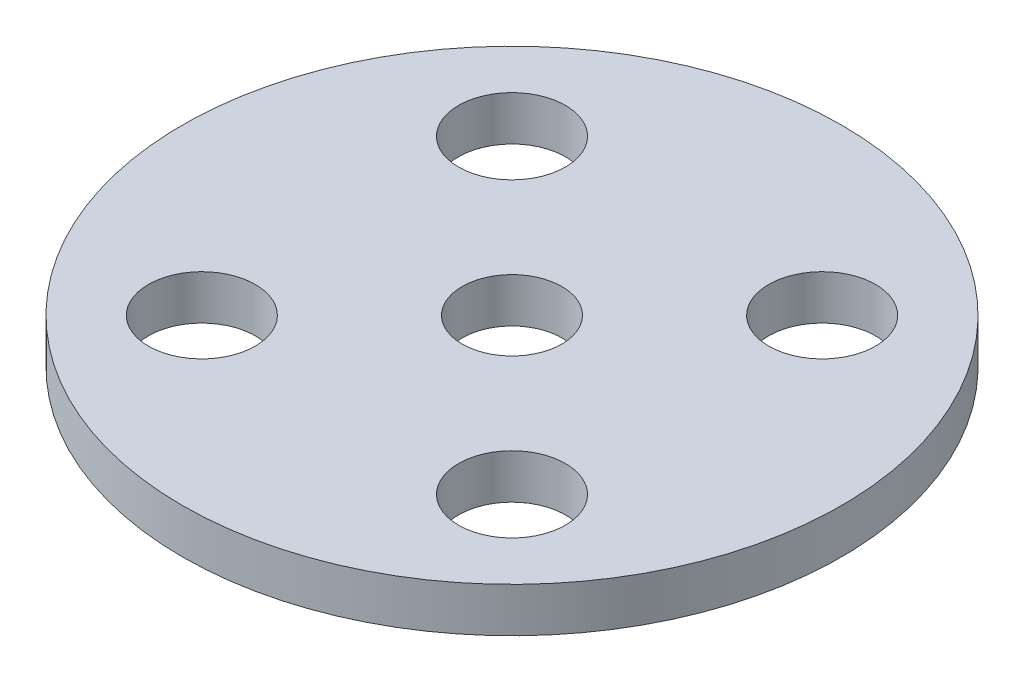
ISO-10303-21;
HEADER;
FILE_DESCRIPTION(('STEP AP214'),'2;1');
FILE_NAME('part.step','',(''),(''),'','','');
FILE_SCHEMA(('AUTOMOTIVE_DESIGN { 1 0 10303 214 1 1 1 1 }'));
ENDSEC;
DATA;
#1=APPLICATION_CONTEXT('core data for automotive mechanical design processes');
#2=APPLICATION_PROTOCOL_DEFINITION('international standard','automotive_design',2000,#1);
#3=PRODUCT_CONTEXT('',#1,'mechanical');
#4=PRODUCT('Part','Part','',(#3));
#5=PRODUCT_RELATED_PRODUCT_CATEGORY('part','',(#4));
#6=PRODUCT_DEFINITION_FORMATION('','',#4);
#7=PRODUCT_DEFINITION_CONTEXT('part definition',#1,'design');
#8=PRODUCT_DEFINITION('design','',#6,#7);
#9=PRODUCT_DEFINITION_SHAPE('','',#8);
#10=(LENGTH_UNIT() NAMED_UNIT(*) SI_UNIT(.MILLI.,.METRE.));
#11=(NAMED_UNIT(*) PLANE_ANGLE_UNIT() SI_UNIT($,.RADIAN.));
#12=(NAMED_UNIT(*) SI_UNIT($,.STERADIAN.) SOLID_ANGLE_UNIT());
#13=UNCERTAINTY_MEASURE_WITH_UNIT(LENGTH_MEASURE(1.E-05),#10,'distance_accuracy_value','');
#14=(GEOMETRIC_REPRESENTATION_CONTEXT(3) GLOBAL_UNCERTAINTY_ASSIGNED_CONTEXT((#13)) GLOBAL_UNIT_ASSIGNED_CONTEXT((#10,
#11,#12)) REPRESENTATION_CONTEXT('',''));
#15=CARTESIAN_POINT('',(0.,0.,0.));
#16=DIRECTION('',(0.,0.,1.));
#17=DIRECTION('',(1.,0.,0.));
#18=AXIS2_PLACEMENT_3D('',#15,#16,#17);
#19=CARTESIAN_POINT('',(0.,3.175,0.));
#20=DIRECTION('',(0.,1.,0.));
#21=DIRECTION('',(0.,0.,1.));
#22=AXIS2_PLACEMENT_3D('',#19,#20,#21);
#23=PLANE('',#22);
#24=CARTESIAN_POINT('',(11.0558684656939,3.175,-11.0558684657014));
#25=DIRECTION('',(0.,1.,0.));
#26=DIRECTION('',(0.,0.,1.));
#27=AXIS2_PLACEMENT_3D('',#24,#25,#26);
#28=CIRCLE('',#27,3.81);
#29=CARTESIAN_POINT('',(11.0558684656939,3.175,-7.24586846570139));
#30=VERTEX_POINT('',#29);
#31=EDGE_CURVE('E60',#30,#30,#28,.T.);
#32=ORIENTED_EDGE('',*,*,#31,.F.);
#33=EDGE_LOOP('',(#32));
#34=FACE_BOUND('',#33,.T.);
#35=CARTESIAN_POINT('',(0.,3.175,0.));
#36=DIRECTION('',(0.,1.,0.));
#37=DIRECTION('',(0.,0.,1.));
#38=AXIS2_PLACEMENT_3D('',#35,#36,#37);
#39=CIRCLE('',#38,3.556);
#40=CARTESIAN_POINT('',(0.,3.175,3.55600000000001));
#41=VERTEX_POINT('',#40);
#42=EDGE_CURVE('E48',#41,#41,#39,.T.);
#43=ORIENTED_EDGE('',*,*,#42,.F.);
#44=EDGE_LOOP('',(#43));
#45=FACE_BOUND('',#44,.T.);
#46=CARTESIAN_POINT('',(0.,3.175,0.));
#47=DIRECTION('',(0.,1.,0.));
#48=DIRECTION('',(0.,0.,1.));
#49=AXIS2_PLACEMENT_3D('',#46,#47,#48);
#50=CIRCLE('',#49,23.495);
#51=CARTESIAN_POINT('',(0.,3.175,23.495));
#52=VERTEX_POINT('',#51);
#53=EDGE_CURVE('E10',#52,#52,#50,.T.);
#54=ORIENTED_EDGE('',*,*,#53,.T.);
#55=EDGE_LOOP('',(#54));
#56=FACE_BOUND('',#55,.T.);
#57=CARTESIAN_POINT('',(-11.0558684656958,3.175,-11.0558684656958));
#58=DIRECTION('',(0.,1.,0.));
#59=DIRECTION('',(0.,0.,1.));
#60=AXIS2_PLACEMENT_3D('',#57,#58,#59);
#61=CIRCLE('',#60,3.81);
#62=CARTESIAN_POINT('',(-11.0558684656958,3.175,-7.24586846569578));
#63=VERTEX_POINT('',#62);
#64=EDGE_CURVE('E43',#63,#63,#61,.T.);
#65=ORIENTED_EDGE('',*,*,#64,.F.);
#66=EDGE_LOOP('',(#65));
#67=FACE_BOUND('',#66,.T.);
#68=CARTESIAN_POINT('',(11.0558684656958,3.175,11.0558684656958));
#69=DIRECTION('',(0.,1.,0.));
#70=DIRECTION('',(0.,0.,1.));
#71=AXIS2_PLACEMENT_3D('',#68,#69,#70);
#72=CIRCLE('',#71,3.81);
#73=CARTESIAN_POINT('',(11.0558684656958,3.175,14.8658684656958));
#74=VERTEX_POINT('',#73);
#75=EDGE_CURVE('E54',#74,#74,#72,.T.);
#76=ORIENTED_EDGE('',*,*,#75,.F.);
#77=EDGE_LOOP('',(#76));
#78=FACE_BOUND('',#77,.T.);
#79=CARTESIAN_POINT('',(-11.0558684656939,3.175,11.0558684656939));
#80=DIRECTION('',(0.,1.,0.));
#81=DIRECTION('',(0.,0.,1.));
#82=AXIS2_PLACEMENT_3D('',#79,#80,#81);
#83=CIRCLE('',#82,3.81);
#84=CARTESIAN_POINT('',(-11.0558684656939,3.175,14.8658684656939));
#85=VERTEX_POINT('',#84);
#86=EDGE_CURVE('E66',#85,#85,#83,.T.);
#87=ORIENTED_EDGE('',*,*,#86,.F.);
#88=EDGE_LOOP('',(#87));
#89=FACE_BOUND('',#88,.T.);
#90=ADVANCED_FACE('F32',(#34,#45,#56,#67,#78,#89),#23,.T.);
#91=CARTESIAN_POINT('',(0.,0.,0.));
#92=DIRECTION('',(0.,1.,0.));
#93=DIRECTION('',(0.,0.,1.));
#94=AXIS2_PLACEMENT_3D('',#91,#92,#93);
#95=PLANE('',#94);
#96=CARTESIAN_POINT('',(0.,0.,0.));
#97=DIRECTION('',(0.,1.,0.));
#98=DIRECTION('',(0.,0.,1.));
#99=AXIS2_PLACEMENT_3D('',#96,#97,#98);
#100=CIRCLE('',#99,23.495);
#101=CARTESIAN_POINT('',(0.,0.,23.495));
#102=VERTEX_POINT('',#101);
#103=EDGE_CURVE('E36',#102,#102,#100,.T.);
#104=ORIENTED_EDGE('',*,*,#103,.F.);
#105=EDGE_LOOP('',(#104));
#106=FACE_BOUND('',#105,.T.);
#107=CARTESIAN_POINT('',(-11.0558684656958,0.,-11.0558684656958));
#108=DIRECTION('',(0.,1.,0.));
#109=DIRECTION('',(0.,0.,1.));
#110=AXIS2_PLACEMENT_3D('',#107,#108,#109);
#111=CIRCLE('',#110,3.81);
#112=CARTESIAN_POINT('',(-11.0558684656958,0.,-7.24586846569578));
#113=VERTEX_POINT('',#112);
#114=EDGE_CURVE('E45',#113,#113,#111,.T.);
#115=ORIENTED_EDGE('',*,*,#114,.T.);
#116=EDGE_LOOP('',(#115));
#117=FACE_BOUND('',#116,.T.);
#118=CARTESIAN_POINT('',(0.,0.,0.));
#119=DIRECTION('',(0.,1.,0.));
#120=DIRECTION('',(0.,0.,1.));
#121=AXIS2_PLACEMENT_3D('',#118,#119,#120);
#122=CIRCLE('',#121,3.556);
#123=CARTESIAN_POINT('',(0.,0.,3.55600000000001));
#124=VERTEX_POINT('',#123);
#125=EDGE_CURVE('E51',#124,#124,#122,.T.);
#126=ORIENTED_EDGE('',*,*,#125,.T.);
#127=EDGE_LOOP('',(#126));
#128=FACE_BOUND('',#127,.T.);
#129=CARTESIAN_POINT('',(11.0558684656958,0.,11.0558684656958));
#130=DIRECTION('',(0.,1.,0.));
#131=DIRECTION('',(0.,0.,1.));
#132=AXIS2_PLACEMENT_3D('',#129,#130,#131);
#133=CIRCLE('',#132,3.81);
#134=CARTESIAN_POINT('',(11.0558684656958,0.,14.8658684656958));
#135=VERTEX_POINT('',#134);
#136=EDGE_CURVE('E57',#135,#135,#133,.T.);
#137=ORIENTED_EDGE('',*,*,#136,.T.);
#138=EDGE_LOOP('',(#137));
#139=FACE_BOUND('',#138,.T.);
#140=CARTESIAN_POINT('',(11.0558684656939,0.,-11.0558684657014));
#141=DIRECTION('',(0.,1.,0.));
#142=DIRECTION('',(0.,0.,1.));
#143=AXIS2_PLACEMENT_3D('',#140,#141,#142);
#144=CIRCLE('',#143,3.81);
#145=CARTESIAN_POINT('',(11.0558684656939,0.,-7.24586846570139));
#146=VERTEX_POINT('',#145);
#147=EDGE_CURVE('E63',#146,#146,#144,.T.);
#148=ORIENTED_EDGE('',*,*,#147,.T.);
#149=EDGE_LOOP('',(#148));
#150=FACE_BOUND('',#149,.T.);
#151=CARTESIAN_POINT('',(-11.0558684656939,0.,11.0558684656939));
#152=DIRECTION('',(0.,1.,0.));
#153=DIRECTION('',(0.,0.,1.));
#154=AXIS2_PLACEMENT_3D('',#151,#152,#153);
#155=CIRCLE('',#154,3.81);
#156=CARTESIAN_POINT('',(-11.0558684656939,0.,14.8658684656939));
#157=VERTEX_POINT('',#156);
#158=EDGE_CURVE('E69',#157,#157,#155,.T.);
#159=ORIENTED_EDGE('',*,*,#158,.T.);
#160=EDGE_LOOP('',(#159));
#161=FACE_BOUND('',#160,.T.);
#162=ADVANCED_FACE('F79',(#106,#117,#128,#139,#150,#161),#95,.F.);
#163=CARTESIAN_POINT('',(0.,3.175,0.));
#164=DIRECTION('',(0.,-1.,0.));
#165=DIRECTION('',(0.,0.,-1.));
#166=AXIS2_PLACEMENT_3D('',#163,#164,#165);
#167=CYLINDRICAL_SURFACE('',#166,23.495);
#168=ORIENTED_EDGE('',*,*,#53,.F.);
#169=EDGE_LOOP('',(#168));
#170=FACE_BOUND('',#169,.T.);
#171=ORIENTED_EDGE('',*,*,#103,.T.);
#172=EDGE_LOOP('',(#171));
#173=FACE_BOUND('',#172,.T.);
#174=ADVANCED_FACE('F34',(#170,#173),#167,.T.);
#175=CARTESIAN_POINT('',(-11.0558684656958,3.175,-11.0558684656958));
#176=DIRECTION('',(0.,-1.,0.));
#177=DIRECTION('',(0.,0.,-1.));
#178=AXIS2_PLACEMENT_3D('',#175,#176,#177);
#179=CYLINDRICAL_SURFACE('',#178,3.81);
#180=ORIENTED_EDGE('',*,*,#64,.T.);
#181=EDGE_LOOP('',(#180));
#182=FACE_BOUND('',#181,.T.);
#183=ORIENTED_EDGE('',*,*,#114,.F.);
#184=EDGE_LOOP('',(#183));
#185=FACE_BOUND('',#184,.T.);
#186=ADVANCED_FACE('F89',(#182,#185),#179,.F.);
#187=CARTESIAN_POINT('',(0.,3.175,0.));
#188=DIRECTION('',(0.,-1.,0.));
#189=DIRECTION('',(0.,0.,-1.));
#190=AXIS2_PLACEMENT_3D('',#187,#188,#189);
#191=CYLINDRICAL_SURFACE('',#190,3.556);
#192=ORIENTED_EDGE('',*,*,#42,.T.);
#193=EDGE_LOOP('',(#192));
#194=FACE_BOUND('',#193,.T.);
#195=ORIENTED_EDGE('',*,*,#125,.F.);
#196=EDGE_LOOP('',(#195));
#197=FACE_BOUND('',#196,.T.);
#198=ADVANCED_FACE('F92',(#194,#197),#191,.F.);
#199=CARTESIAN_POINT('',(11.0558684656958,3.175,11.0558684656958));
#200=DIRECTION('',(0.,-1.,0.));
#201=DIRECTION('',(0.,0.,-1.));
#202=AXIS2_PLACEMENT_3D('',#199,#200,#201);
#203=CYLINDRICAL_SURFACE('',#202,3.81);
#204=ORIENTED_EDGE('',*,*,#75,.T.);
#205=EDGE_LOOP('',(#204));
#206=FACE_BOUND('',#205,.T.);
#207=ORIENTED_EDGE('',*,*,#136,.F.);
#208=EDGE_LOOP('',(#207));
#209=FACE_BOUND('',#208,.T.);
#210=ADVANCED_FACE('F96',(#206,#209),#203,.F.);
#211=CARTESIAN_POINT('',(11.0558684656939,3.175,-11.0558684657014));
#212=DIRECTION('',(0.,-1.,0.));
#213=DIRECTION('',(0.,0.,-1.));
#214=AXIS2_PLACEMENT_3D('',#211,#212,#213);
#215=CYLINDRICAL_SURFACE('',#214,3.81);
#216=ORIENTED_EDGE('',*,*,#31,.T.);
#217=EDGE_LOOP('',(#216));
#218=FACE_BOUND('',#217,.T.);
#219=ORIENTED_EDGE('',*,*,#147,.F.);
#220=EDGE_LOOP('',(#219));
#221=FACE_BOUND('',#220,.T.);
#222=ADVANCED_FACE('F100',(#218,#221),#215,.F.);
#223=CARTESIAN_POINT('',(-11.0558684656939,3.175,11.0558684656939));
#224=DIRECTION('',(0.,-1.,0.));
#225=DIRECTION('',(0.,0.,-1.));
#226=AXIS2_PLACEMENT_3D('',#223,#224,#225);
#227=CYLINDRICAL_SURFACE('',#226,3.81);
#228=ORIENTED_EDGE('',*,*,#86,.T.);
#229=EDGE_LOOP('',(#228));
#230=FACE_BOUND('',#229,.T.);
#231=ORIENTED_EDGE('',*,*,#158,.F.);
#232=EDGE_LOOP('',(#231));
#233=FACE_BOUND('',#232,.T.);
#234=ADVANCED_FACE('F75',(#230,#233),#227,.F.);
#235=CLOSED_SHELL('',(#90,#162,#174,#186,#198,#210,#222,#234));
#236=MANIFOLD_SOLID_BREP('B2',#235);
#237=ADVANCED_BREP_SHAPE_REPRESENTATION('',(#18,#236),#14);
#238=SHAPE_DEFINITION_REPRESENTATION(#9,#237);
ENDSEC;
END-ISO-10303-21;
